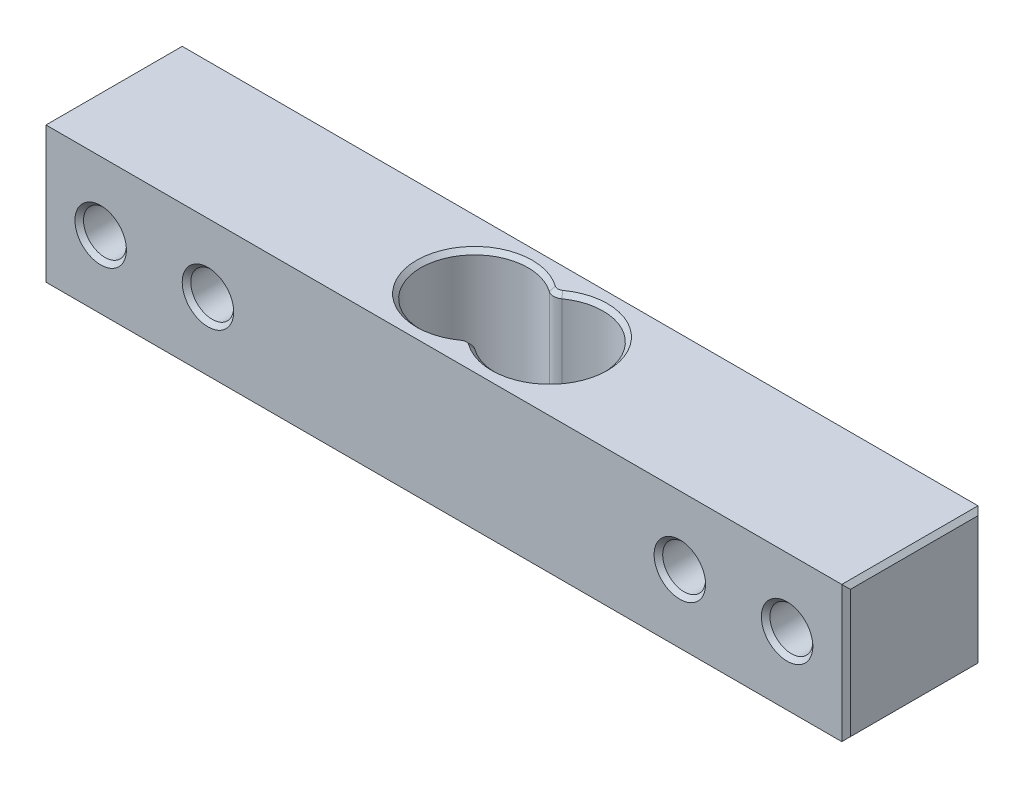
ISO-10303-21;
HEADER;
FILE_DESCRIPTION(('STEP AP214'),'2;1');
FILE_NAME('part.step','',(''),(''),'','','');
FILE_SCHEMA(('AUTOMOTIVE_DESIGN { 1 0 10303 214 1 1 1 1 }'));
ENDSEC;
DATA;
#1=APPLICATION_CONTEXT('core data for automotive mechanical design processes');
#2=APPLICATION_PROTOCOL_DEFINITION('international standard','automotive_design',2000,#1);
#3=PRODUCT_CONTEXT('',#1,'mechanical');
#4=PRODUCT('Part','Part','',(#3));
#5=PRODUCT_RELATED_PRODUCT_CATEGORY('part','',(#4));
#6=PRODUCT_DEFINITION_FORMATION('','',#4);
#7=PRODUCT_DEFINITION_CONTEXT('part definition',#1,'design');
#8=PRODUCT_DEFINITION('design','',#6,#7);
#9=PRODUCT_DEFINITION_SHAPE('','',#8);
#10=(LENGTH_UNIT() NAMED_UNIT(*) SI_UNIT(.MILLI.,.METRE.));
#11=(NAMED_UNIT(*) PLANE_ANGLE_UNIT() SI_UNIT($,.RADIAN.));
#12=(NAMED_UNIT(*) SI_UNIT($,.STERADIAN.) SOLID_ANGLE_UNIT());
#13=UNCERTAINTY_MEASURE_WITH_UNIT(LENGTH_MEASURE(1.E-05),#10,'distance_accuracy_value','');
#14=(GEOMETRIC_REPRESENTATION_CONTEXT(3) GLOBAL_UNCERTAINTY_ASSIGNED_CONTEXT((#13)) GLOBAL_UNIT_ASSIGNED_CONTEXT((#10,
#11,#12)) REPRESENTATION_CONTEXT('',''));
#15=CARTESIAN_POINT('',(0.,0.,0.));
#16=DIRECTION('',(0.,0.,1.));
#17=DIRECTION('',(1.,0.,0.));
#18=AXIS2_PLACEMENT_3D('',#15,#16,#17);
#19=CARTESIAN_POINT('',(0.,0.,12.7));
#20=DIRECTION('',(0.,0.,-1.));
#21=DIRECTION('',(-1.,0.,0.));
#22=AXIS2_PLACEMENT_3D('',#19,#20,#21);
#23=PLANE('',#22);
#24=CARTESIAN_POINT('',(32.,0.,12.7));
#25=DIRECTION('',(0.,0.,-1.));
#26=DIRECTION('',(-1.,0.,0.));
#27=AXIS2_PLACEMENT_3D('',#24,#25,#26);
#28=CIRCLE('',#27,2.39999999999999);
#29=CARTESIAN_POINT('',(29.6,0.,12.7));
#30=VERTEX_POINT('',#29);
#31=EDGE_CURVE('E260',#30,#30,#28,.T.);
#32=ORIENTED_EDGE('',*,*,#31,.T.);
#33=EDGE_LOOP('',(#32));
#34=FACE_BOUND('',#33,.T.);
#35=CARTESIAN_POINT('',(22.,0.,12.7));
#36=DIRECTION('',(0.,0.,-1.));
#37=DIRECTION('',(-1.,0.,0.));
#38=AXIS2_PLACEMENT_3D('',#35,#36,#37);
#39=CIRCLE('',#38,2.4);
#40=CARTESIAN_POINT('',(19.6,0.,12.7));
#41=VERTEX_POINT('',#40);
#42=EDGE_CURVE('E257',#41,#41,#39,.T.);
#43=ORIENTED_EDGE('',*,*,#42,.T.);
#44=EDGE_LOOP('',(#43));
#45=FACE_BOUND('',#44,.T.);
#46=CARTESIAN_POINT('',(-22.,0.,12.7));
#47=DIRECTION('',(0.,0.,-1.));
#48=DIRECTION('',(-1.,0.,0.));
#49=AXIS2_PLACEMENT_3D('',#46,#47,#48);
#50=CIRCLE('',#49,2.4);
#51=CARTESIAN_POINT('',(-24.4,0.,12.7));
#52=VERTEX_POINT('',#51);
#53=EDGE_CURVE('E254',#52,#52,#50,.T.);
#54=ORIENTED_EDGE('',*,*,#53,.T.);
#55=EDGE_LOOP('',(#54));
#56=FACE_BOUND('',#55,.T.);
#57=CARTESIAN_POINT('',(-32.,0.,12.7));
#58=DIRECTION('',(0.,0.,-1.));
#59=DIRECTION('',(-1.,0.,0.));
#60=AXIS2_PLACEMENT_3D('',#57,#58,#59);
#61=CIRCLE('',#60,2.4);
#62=CARTESIAN_POINT('',(-34.4,0.,12.7));
#63=VERTEX_POINT('',#62);
#64=EDGE_CURVE('E251',#63,#63,#61,.T.);
#65=ORIENTED_EDGE('',*,*,#64,.T.);
#66=EDGE_LOOP('',(#65));
#67=FACE_BOUND('',#66,.T.);
#68=DIRECTION('',(-1.,0.,0.));
#69=VECTOR('',#68,1.);
#70=CARTESIAN_POINT('',(-37.5,6.35,12.7));
#71=LINE('',#70,#69);
#72=CARTESIAN_POINT('',(37.1,6.35,12.7));
#73=VERTEX_POINT('',#72);
#74=CARTESIAN_POINT('',(-37.1,6.35,12.7));
#75=VERTEX_POINT('',#74);
#76=EDGE_CURVE('E357',#73,#75,#71,.T.);
#77=ORIENTED_EDGE('',*,*,#76,.T.);
#78=DIRECTION('',(0.,-1.,0.));
#79=VECTOR('',#78,1.);
#80=CARTESIAN_POINT('',(-37.1,0.,12.7));
#81=LINE('',#80,#79);
#82=CARTESIAN_POINT('',(-37.1,-6.35,12.7));
#83=VERTEX_POINT('',#82);
#84=EDGE_CURVE('E265',#75,#83,#81,.T.);
#85=ORIENTED_EDGE('',*,*,#84,.T.);
#86=DIRECTION('',(1.,0.,0.));
#87=VECTOR('',#86,1.);
#88=CARTESIAN_POINT('',(-37.5,-6.35,12.7));
#89=LINE('',#88,#87);
#90=CARTESIAN_POINT('',(37.1,-6.35,12.7));
#91=VERTEX_POINT('',#90);
#92=EDGE_CURVE('E203',#83,#91,#89,.T.);
#93=ORIENTED_EDGE('',*,*,#92,.T.);
#94=DIRECTION('',(0.,1.,0.));
#95=VECTOR('',#94,1.);
#96=CARTESIAN_POINT('',(37.1,0.,12.7));
#97=LINE('',#96,#95);
#98=EDGE_CURVE('E263',#91,#73,#97,.T.);
#99=ORIENTED_EDGE('',*,*,#98,.T.);
#100=EDGE_LOOP('',(#77,#85,#93,#99));
#101=FACE_BOUND('',#100,.T.);
#102=ADVANCED_FACE('F42',(#34,#45,#56,#67,#101),#23,.F.);
#103=CARTESIAN_POINT('',(0.,0.,0.));
#104=DIRECTION('',(0.,0.,-1.));
#105=DIRECTION('',(-1.,0.,0.));
#106=AXIS2_PLACEMENT_3D('',#103,#104,#105);
#107=PLANE('',#106);
#108=CARTESIAN_POINT('',(32.,0.,0.));
#109=DIRECTION('',(0.,0.,-1.));
#110=DIRECTION('',(-1.,0.,0.));
#111=AXIS2_PLACEMENT_3D('',#108,#109,#110);
#112=CIRCLE('',#111,2.40000000000001);
#113=CARTESIAN_POINT('',(29.6,0.,0.));
#114=VERTEX_POINT('',#113);
#115=EDGE_CURVE('E276',#114,#114,#112,.F.);
#116=ORIENTED_EDGE('',*,*,#115,.T.);
#117=EDGE_LOOP('',(#116));
#118=FACE_BOUND('',#117,.T.);
#119=CARTESIAN_POINT('',(22.,0.,0.));
#120=DIRECTION('',(0.,0.,-1.));
#121=DIRECTION('',(-1.,0.,0.));
#122=AXIS2_PLACEMENT_3D('',#119,#120,#121);
#123=CIRCLE('',#122,2.40000000000001);
#124=CARTESIAN_POINT('',(19.6,0.,0.));
#125=VERTEX_POINT('',#124);
#126=EDGE_CURVE('E273',#125,#125,#123,.F.);
#127=ORIENTED_EDGE('',*,*,#126,.T.);
#128=EDGE_LOOP('',(#127));
#129=FACE_BOUND('',#128,.T.);
#130=CARTESIAN_POINT('',(-22.,0.,0.));
#131=DIRECTION('',(0.,0.,-1.));
#132=DIRECTION('',(-1.,0.,0.));
#133=AXIS2_PLACEMENT_3D('',#130,#131,#132);
#134=CIRCLE('',#133,2.40000000000001);
#135=CARTESIAN_POINT('',(-24.4,0.,0.));
#136=VERTEX_POINT('',#135);
#137=EDGE_CURVE('E270',#136,#136,#134,.F.);
#138=ORIENTED_EDGE('',*,*,#137,.T.);
#139=EDGE_LOOP('',(#138));
#140=FACE_BOUND('',#139,.T.);
#141=CARTESIAN_POINT('',(-32.,0.,0.));
#142=DIRECTION('',(0.,0.,-1.));
#143=DIRECTION('',(-1.,0.,0.));
#144=AXIS2_PLACEMENT_3D('',#141,#142,#143);
#145=CIRCLE('',#144,2.40000000000001);
#146=CARTESIAN_POINT('',(-34.4,0.,0.));
#147=VERTEX_POINT('',#146);
#148=EDGE_CURVE('E267',#147,#147,#145,.F.);
#149=ORIENTED_EDGE('',*,*,#148,.T.);
#150=EDGE_LOOP('',(#149));
#151=FACE_BOUND('',#150,.T.);
#152=DIRECTION('',(1.,0.,0.));
#153=VECTOR('',#152,1.);
#154=CARTESIAN_POINT('',(-37.5,-6.35,0.));
#155=LINE('',#154,#153);
#156=CARTESIAN_POINT('',(-37.1,-6.35,0.));
#157=VERTEX_POINT('',#156);
#158=CARTESIAN_POINT('',(37.1,-6.35,0.));
#159=VERTEX_POINT('',#158);
#160=EDGE_CURVE('E363',#157,#159,#155,.T.);
#161=ORIENTED_EDGE('',*,*,#160,.F.);
#162=DIRECTION('',(0.,1.,0.));
#163=VECTOR('',#162,1.);
#164=CARTESIAN_POINT('',(-37.1,6.35,0.));
#165=LINE('',#164,#163);
#166=CARTESIAN_POINT('',(-37.1,6.35,0.));
#167=VERTEX_POINT('',#166);
#168=EDGE_CURVE('E281',#157,#167,#165,.T.);
#169=ORIENTED_EDGE('',*,*,#168,.T.);
#170=DIRECTION('',(-1.,0.,0.));
#171=VECTOR('',#170,1.);
#172=CARTESIAN_POINT('',(-37.5,6.35,0.));
#173=LINE('',#172,#171);
#174=CARTESIAN_POINT('',(37.1,6.35,0.));
#175=VERTEX_POINT('',#174);
#176=EDGE_CURVE('E314',#175,#167,#173,.T.);
#177=ORIENTED_EDGE('',*,*,#176,.F.);
#178=DIRECTION('',(0.,-1.,0.));
#179=VECTOR('',#178,1.);
#180=CARTESIAN_POINT('',(37.1,-6.35,0.));
#181=LINE('',#180,#179);
#182=EDGE_CURVE('E279',#175,#159,#181,.T.);
#183=ORIENTED_EDGE('',*,*,#182,.T.);
#184=EDGE_LOOP('',(#161,#169,#177,#183));
#185=FACE_BOUND('',#184,.T.);
#186=ADVANCED_FACE('F360',(#118,#129,#140,#151,#185),#107,.T.);
#187=CARTESIAN_POINT('',(37.5,-6.35,12.7));
#188=DIRECTION('',(-1.,0.,0.));
#189=DIRECTION('',(0.,0.,1.));
#190=AXIS2_PLACEMENT_3D('',#187,#188,#189);
#191=PLANE('',#190);
#192=DIRECTION('',(0.,-1.,0.));
#193=VECTOR('',#192,1.);
#194=CARTESIAN_POINT('',(37.5,-6.35,12.3));
#195=LINE('',#194,#193);
#196=CARTESIAN_POINT('',(37.5,5.95,12.3));
#197=VERTEX_POINT('',#196);
#198=CARTESIAN_POINT('',(37.5,-5.95,12.3));
#199=VERTEX_POINT('',#198);
#200=EDGE_CURVE('E60',#197,#199,#195,.T.);
#201=ORIENTED_EDGE('',*,*,#200,.T.);
#202=DIRECTION('',(0.,0.,-1.));
#203=VECTOR('',#202,1.);
#204=CARTESIAN_POINT('',(37.5,-5.95,12.7));
#205=LINE('',#204,#203);
#206=CARTESIAN_POINT('',(37.5,-5.95,0.399999999999998));
#207=VERTEX_POINT('',#206);
#208=EDGE_CURVE('E287',#199,#207,#205,.T.);
#209=ORIENTED_EDGE('',*,*,#208,.T.);
#210=DIRECTION('',(0.,1.,0.));
#211=VECTOR('',#210,1.);
#212=CARTESIAN_POINT('',(37.5,6.35,0.399999999999998));
#213=LINE('',#212,#211);
#214=CARTESIAN_POINT('',(37.5,5.95,0.399999999999998));
#215=VERTEX_POINT('',#214);
#216=EDGE_CURVE('E283',#207,#215,#213,.T.);
#217=ORIENTED_EDGE('',*,*,#216,.T.);
#218=DIRECTION('',(0.,0.,1.));
#219=VECTOR('',#218,1.);
#220=CARTESIAN_POINT('',(37.5,5.95,12.7));
#221=LINE('',#220,#219);
#222=EDGE_CURVE('E65',#215,#197,#221,.T.);
#223=ORIENTED_EDGE('',*,*,#222,.T.);
#224=EDGE_LOOP('',(#201,#209,#217,#223));
#225=FACE_BOUND('',#224,.T.);
#226=ADVANCED_FACE('F409',(#225),#191,.F.);
#227=CARTESIAN_POINT('',(-37.5,6.35,12.7));
#228=DIRECTION('',(0.,-1.,0.));
#229=DIRECTION('',(0.,0.,-1.));
#230=AXIS2_PLACEMENT_3D('',#227,#228,#229);
#231=PLANE('',#230);
#232=CARTESIAN_POINT('',(0.,6.35,1.47660282759551));
#233=DIRECTION('',(0.,-1.,0.));
#234=DIRECTION('',(0.,0.,-1.));
#235=AXIS2_PLACEMENT_3D('',#232,#233,#234);
#236=CIRCLE('',#235,0.60000000000002);
#237=CARTESIAN_POINT('',(-0.350000000000014,6.35,1.96394254483598));
#238=VERTEX_POINT('',#237);
#239=CARTESIAN_POINT('',(0.35000000000001,6.35,1.96394254483598));
#240=VERTEX_POINT('',#239);
#241=EDGE_CURVE('E237',#238,#240,#236,.F.);
#242=ORIENTED_EDGE('',*,*,#241,.T.);
#243=CARTESIAN_POINT('',(3.5,6.35,6.35));
#244=DIRECTION('',(0.,-1.,0.));
#245=DIRECTION('',(0.,0.,-1.));
#246=AXIS2_PLACEMENT_3D('',#243,#244,#245);
#247=CIRCLE('',#246,5.39999999999998);
#248=CARTESIAN_POINT('',(0.350000000000009,6.35,10.736057455164));
#249=VERTEX_POINT('',#248);
#250=EDGE_CURVE('E239',#240,#249,#247,.T.);
#251=ORIENTED_EDGE('',*,*,#250,.T.);
#252=CARTESIAN_POINT('',(0.,6.35,11.2233971724045));
#253=DIRECTION('',(0.,-1.,0.));
#254=DIRECTION('',(0.,0.,-1.));
#255=AXIS2_PLACEMENT_3D('',#252,#253,#254);
#256=CIRCLE('',#255,0.60000000000002);
#257=CARTESIAN_POINT('',(-0.350000000000014,6.35,10.736057455164));
#258=VERTEX_POINT('',#257);
#259=EDGE_CURVE('E235',#249,#258,#256,.F.);
#260=ORIENTED_EDGE('',*,*,#259,.T.);
#261=CARTESIAN_POINT('',(-3.5,6.35,6.35));
#262=DIRECTION('',(0.,-1.,0.));
#263=DIRECTION('',(0.,0.,-1.));
#264=AXIS2_PLACEMENT_3D('',#261,#262,#263);
#265=CIRCLE('',#264,5.39999999999998);
#266=EDGE_CURVE('E233',#258,#238,#265,.T.);
#267=ORIENTED_EDGE('',*,*,#266,.T.);
#268=EDGE_LOOP('',(#242,#251,#260,#267));
#269=FACE_BOUND('',#268,.T.);
#270=ORIENTED_EDGE('',*,*,#176,.T.);
#271=DIRECTION('',(0.,0.,1.));
#272=VECTOR('',#271,1.);
#273=CARTESIAN_POINT('',(-37.1,6.35,12.7));
#274=LINE('',#273,#272);
#275=EDGE_CURVE('E230',#167,#75,#274,.T.);
#276=ORIENTED_EDGE('',*,*,#275,.T.);
#277=ORIENTED_EDGE('',*,*,#76,.F.);
#278=DIRECTION('',(0.,0.,-1.));
#279=VECTOR('',#278,1.);
#280=CARTESIAN_POINT('',(37.1,6.35,12.7));
#281=LINE('',#280,#279);
#282=EDGE_CURVE('E228',#73,#175,#281,.T.);
#283=ORIENTED_EDGE('',*,*,#282,.T.);
#284=EDGE_LOOP('',(#270,#276,#277,#283));
#285=FACE_BOUND('',#284,.T.);
#286=ADVANCED_FACE('F354',(#269,#285),#231,.F.);
#287=CARTESIAN_POINT('',(-37.5,-6.35,12.7));
#288=DIRECTION('',(1.,0.,0.));
#289=DIRECTION('',(0.,0.,-1.));
#290=AXIS2_PLACEMENT_3D('',#287,#288,#289);
#291=PLANE('',#290);
#292=DIRECTION('',(0.,1.,0.));
#293=VECTOR('',#292,1.);
#294=CARTESIAN_POINT('',(-37.5,-6.35,12.3));
#295=LINE('',#294,#293);
#296=CARTESIAN_POINT('',(-37.5,-5.95,12.3));
#297=VERTEX_POINT('',#296);
#298=CARTESIAN_POINT('',(-37.5,5.95,12.3));
#299=VERTEX_POINT('',#298);
#300=EDGE_CURVE('E246',#297,#299,#295,.T.);
#301=ORIENTED_EDGE('',*,*,#300,.T.);
#302=DIRECTION('',(0.,0.,-1.));
#303=VECTOR('',#302,1.);
#304=CARTESIAN_POINT('',(-37.5,5.95,12.7));
#305=LINE('',#304,#303);
#306=CARTESIAN_POINT('',(-37.5,5.95,0.399999999999998));
#307=VERTEX_POINT('',#306);
#308=EDGE_CURVE('E248',#299,#307,#305,.T.);
#309=ORIENTED_EDGE('',*,*,#308,.T.);
#310=DIRECTION('',(0.,-1.,0.));
#311=VECTOR('',#310,1.);
#312=CARTESIAN_POINT('',(-37.5,-6.35,0.399999999999998));
#313=LINE('',#312,#311);
#314=CARTESIAN_POINT('',(-37.5,-5.95,0.399999999999998));
#315=VERTEX_POINT('',#314);
#316=EDGE_CURVE('E242',#307,#315,#313,.T.);
#317=ORIENTED_EDGE('',*,*,#316,.T.);
#318=DIRECTION('',(0.,0.,1.));
#319=VECTOR('',#318,1.);
#320=CARTESIAN_POINT('',(-37.5,-5.95,12.7));
#321=LINE('',#320,#319);
#322=EDGE_CURVE('E244',#315,#297,#321,.T.);
#323=ORIENTED_EDGE('',*,*,#322,.T.);
#324=EDGE_LOOP('',(#301,#309,#317,#323));
#325=FACE_BOUND('',#324,.T.);
#326=ADVANCED_FACE('F386',(#325),#291,.F.);
#327=CARTESIAN_POINT('',(-37.5,-6.35,12.7));
#328=DIRECTION('',(0.,1.,0.));
#329=DIRECTION('',(0.,0.,1.));
#330=AXIS2_PLACEMENT_3D('',#327,#328,#329);
#331=PLANE('',#330);
#332=CARTESIAN_POINT('',(0.,-6.35,11.2233971724045));
#333=DIRECTION('',(0.,1.,0.));
#334=DIRECTION('',(0.,0.,1.));
#335=AXIS2_PLACEMENT_3D('',#332,#333,#334);
#336=CIRCLE('',#335,0.600000000000012);
#337=CARTESIAN_POINT('',(-0.35000000000001,-6.35,10.736057455164));
#338=VERTEX_POINT('',#337);
#339=CARTESIAN_POINT('',(0.350000000000005,-6.35,10.736057455164));
#340=VERTEX_POINT('',#339);
#341=EDGE_CURVE('E217',#338,#340,#336,.F.);
#342=ORIENTED_EDGE('',*,*,#341,.T.);
#343=CARTESIAN_POINT('',(3.5,-6.35,6.35));
#344=DIRECTION('',(0.,1.,0.));
#345=DIRECTION('',(0.,0.,1.));
#346=AXIS2_PLACEMENT_3D('',#343,#344,#345);
#347=CIRCLE('',#346,5.39999999999999);
#348=CARTESIAN_POINT('',(0.350000000000005,-6.35,1.96394254483597));
#349=VERTEX_POINT('',#348);
#350=EDGE_CURVE('E165',#340,#349,#347,.T.);
#351=ORIENTED_EDGE('',*,*,#350,.T.);
#352=CARTESIAN_POINT('',(0.,-6.35,1.47660282759551));
#353=DIRECTION('',(0.,1.,0.));
#354=DIRECTION('',(0.,0.,1.));
#355=AXIS2_PLACEMENT_3D('',#352,#353,#354);
#356=CIRCLE('',#355,0.600000000000013);
#357=CARTESIAN_POINT('',(-0.350000000000009,-6.35,1.96394254483597));
#358=VERTEX_POINT('',#357);
#359=EDGE_CURVE('E215',#349,#358,#356,.F.);
#360=ORIENTED_EDGE('',*,*,#359,.T.);
#361=CARTESIAN_POINT('',(-3.5,-6.35,6.35));
#362=DIRECTION('',(0.,1.,0.));
#363=DIRECTION('',(0.,0.,1.));
#364=AXIS2_PLACEMENT_3D('',#361,#362,#363);
#365=CIRCLE('',#364,5.39999999999999);
#366=EDGE_CURVE('E213',#358,#338,#365,.T.);
#367=ORIENTED_EDGE('',*,*,#366,.T.);
#368=EDGE_LOOP('',(#342,#351,#360,#367));
#369=FACE_BOUND('',#368,.T.);
#370=ORIENTED_EDGE('',*,*,#92,.F.);
#371=DIRECTION('',(0.,0.,-1.));
#372=VECTOR('',#371,1.);
#373=CARTESIAN_POINT('',(-37.1,-6.35,12.7));
#374=LINE('',#373,#372);
#375=EDGE_CURVE('E211',#83,#157,#374,.T.);
#376=ORIENTED_EDGE('',*,*,#375,.T.);
#377=ORIENTED_EDGE('',*,*,#160,.T.);
#378=DIRECTION('',(0.,0.,1.));
#379=VECTOR('',#378,1.);
#380=CARTESIAN_POINT('',(37.1,-6.35,12.7));
#381=LINE('',#380,#379);
#382=EDGE_CURVE('E193',#159,#91,#381,.T.);
#383=ORIENTED_EDGE('',*,*,#382,.T.);
#384=EDGE_LOOP('',(#370,#376,#377,#383));
#385=FACE_BOUND('',#384,.T.);
#386=ADVANCED_FACE('F373',(#369,#385),#331,.F.);
#387=CARTESIAN_POINT('',(-32.,0.,12.7));
#388=DIRECTION('',(0.,0.,-1.));
#389=DIRECTION('',(-1.,0.,0.));
#390=AXIS2_PLACEMENT_3D('',#387,#388,#389);
#391=CYLINDRICAL_SURFACE('',#390,2.);
#392=CARTESIAN_POINT('',(-32.,0.,0.400000000000003));
#393=DIRECTION('',(0.,0.,-1.));
#394=DIRECTION('',(-1.,0.,0.));
#395=AXIS2_PLACEMENT_3D('',#392,#393,#394);
#396=CIRCLE('',#395,2.);
#397=CARTESIAN_POINT('',(-34.,0.,0.400000000000003));
#398=VERTEX_POINT('',#397);
#399=EDGE_CURVE('E11',#398,#398,#396,.T.);
#400=ORIENTED_EDGE('',*,*,#399,.T.);
#401=EDGE_LOOP('',(#400));
#402=FACE_BOUND('',#401,.T.);
#403=CARTESIAN_POINT('',(-32.,0.,12.3));
#404=DIRECTION('',(0.,0.,-1.));
#405=DIRECTION('',(-1.,0.,0.));
#406=AXIS2_PLACEMENT_3D('',#403,#404,#405);
#407=CIRCLE('',#406,2.);
#408=CARTESIAN_POINT('',(-34.,0.,12.3));
#409=VERTEX_POINT('',#408);
#410=EDGE_CURVE('E52',#409,#409,#407,.F.);
#411=ORIENTED_EDGE('',*,*,#410,.T.);
#412=EDGE_LOOP('',(#411));
#413=FACE_BOUND('',#412,.T.);
#414=ADVANCED_FACE('F414',(#402,#413),#391,.F.);
#415=CARTESIAN_POINT('',(-22.,0.,12.7));
#416=DIRECTION('',(0.,0.,-1.));
#417=DIRECTION('',(-1.,0.,0.));
#418=AXIS2_PLACEMENT_3D('',#415,#416,#417);
#419=CYLINDRICAL_SURFACE('',#418,2.);
#420=CARTESIAN_POINT('',(-22.,0.,0.400000000000003));
#421=DIRECTION('',(0.,0.,-1.));
#422=DIRECTION('',(-1.,0.,0.));
#423=AXIS2_PLACEMENT_3D('',#420,#421,#422);
#424=CIRCLE('',#423,2.);
#425=CARTESIAN_POINT('',(-24.,0.,0.400000000000003));
#426=VERTEX_POINT('',#425);
#427=EDGE_CURVE('E304',#426,#426,#424,.T.);
#428=ORIENTED_EDGE('',*,*,#427,.T.);
#429=EDGE_LOOP('',(#428));
#430=FACE_BOUND('',#429,.T.);
#431=CARTESIAN_POINT('',(-22.,0.,12.3));
#432=DIRECTION('',(0.,0.,-1.));
#433=DIRECTION('',(-1.,0.,0.));
#434=AXIS2_PLACEMENT_3D('',#431,#432,#433);
#435=CIRCLE('',#434,2.);
#436=CARTESIAN_POINT('',(-24.,0.,12.3));
#437=VERTEX_POINT('',#436);
#438=EDGE_CURVE('E301',#437,#437,#435,.F.);
#439=ORIENTED_EDGE('',*,*,#438,.T.);
#440=EDGE_LOOP('',(#439));
#441=FACE_BOUND('',#440,.T.);
#442=ADVANCED_FACE('F517',(#430,#441),#419,.F.);
#443=CARTESIAN_POINT('',(22.,0.,12.7));
#444=DIRECTION('',(0.,0.,-1.));
#445=DIRECTION('',(-1.,0.,0.));
#446=AXIS2_PLACEMENT_3D('',#443,#444,#445);
#447=CYLINDRICAL_SURFACE('',#446,2.);
#448=CARTESIAN_POINT('',(22.,0.,0.400000000000003));
#449=DIRECTION('',(0.,0.,-1.));
#450=DIRECTION('',(-1.,0.,0.));
#451=AXIS2_PLACEMENT_3D('',#448,#449,#450);
#452=CIRCLE('',#451,2.);
#453=CARTESIAN_POINT('',(20.,0.,0.400000000000003));
#454=VERTEX_POINT('',#453);
#455=EDGE_CURVE('E298',#454,#454,#452,.T.);
#456=ORIENTED_EDGE('',*,*,#455,.T.);
#457=EDGE_LOOP('',(#456));
#458=FACE_BOUND('',#457,.T.);
#459=CARTESIAN_POINT('',(22.,0.,12.3));
#460=DIRECTION('',(0.,0.,-1.));
#461=DIRECTION('',(-1.,0.,0.));
#462=AXIS2_PLACEMENT_3D('',#459,#460,#461);
#463=CIRCLE('',#462,2.);
#464=CARTESIAN_POINT('',(20.,0.,12.3));
#465=VERTEX_POINT('',#464);
#466=EDGE_CURVE('E295',#465,#465,#463,.F.);
#467=ORIENTED_EDGE('',*,*,#466,.T.);
#468=EDGE_LOOP('',(#467));
#469=FACE_BOUND('',#468,.T.);
#470=ADVANCED_FACE('F514',(#458,#469),#447,.F.);
#471=CARTESIAN_POINT('',(32.,0.,12.7));
#472=DIRECTION('',(0.,0.,-1.));
#473=DIRECTION('',(-1.,0.,0.));
#474=AXIS2_PLACEMENT_3D('',#471,#472,#473);
#475=CYLINDRICAL_SURFACE('',#474,2.);
#476=CARTESIAN_POINT('',(32.,0.,0.400000000000003));
#477=DIRECTION('',(0.,0.,-1.));
#478=DIRECTION('',(-1.,0.,0.));
#479=AXIS2_PLACEMENT_3D('',#476,#477,#478);
#480=CIRCLE('',#479,2.);
#481=CARTESIAN_POINT('',(30.,0.,0.400000000000003));
#482=VERTEX_POINT('',#481);
#483=EDGE_CURVE('E292',#482,#482,#480,.T.);
#484=ORIENTED_EDGE('',*,*,#483,.T.);
#485=EDGE_LOOP('',(#484));
#486=FACE_BOUND('',#485,.T.);
#487=CARTESIAN_POINT('',(32.,0.,12.3));
#488=DIRECTION('',(0.,0.,-1.));
#489=DIRECTION('',(-1.,0.,0.));
#490=AXIS2_PLACEMENT_3D('',#487,#488,#489);
#491=CIRCLE('',#490,2.);
#492=CARTESIAN_POINT('',(30.,0.,12.3));
#493=VERTEX_POINT('',#492);
#494=EDGE_CURVE('E289',#493,#493,#491,.F.);
#495=ORIENTED_EDGE('',*,*,#494,.T.);
#496=EDGE_LOOP('',(#495));
#497=FACE_BOUND('',#496,.T.);
#498=ADVANCED_FACE('F509',(#486,#497),#475,.F.);
#499=CARTESIAN_POINT('',(3.5,-6.351,6.35));
#500=DIRECTION('',(0.,1.,0.));
#501=DIRECTION('',(0.,0.,1.));
#502=AXIS2_PLACEMENT_3D('',#499,#500,#501);
#503=CYLINDRICAL_SURFACE('',#502,5.);
#504=DIRECTION('',(0.,1.,0.));
#505=VECTOR('',#504,1.);
#506=CARTESIAN_POINT('',(0.583333333333331,-6.351,2.28883568966293));
#507=LINE('',#506,#505);
#508=CARTESIAN_POINT('',(0.583333333333331,5.95000000000002,2.28883568966293));
#509=VERTEX_POINT('',#508);
#510=CARTESIAN_POINT('',(0.583333333333331,-5.95000000000002,2.28883568966293));
#511=VERTEX_POINT('',#510);
#512=EDGE_CURVE('E191',#509,#511,#507,.F.);
#513=ORIENTED_EDGE('',*,*,#512,.T.);
#514=CARTESIAN_POINT('',(3.5,-5.95000000000002,6.35));
#515=DIRECTION('',(0.,1.,0.));
#516=DIRECTION('',(0.,0.,1.));
#517=AXIS2_PLACEMENT_3D('',#514,#515,#516);
#518=CIRCLE('',#517,5.);
#519=CARTESIAN_POINT('',(0.583333333333331,-5.95000000000002,10.4111643103371));
#520=VERTEX_POINT('',#519);
#521=EDGE_CURVE('E163',#511,#520,#518,.F.);
#522=ORIENTED_EDGE('',*,*,#521,.T.);
#523=DIRECTION('',(0.,1.,0.));
#524=VECTOR('',#523,1.);
#525=CARTESIAN_POINT('',(0.583333333333331,-6.351,10.4111643103371));
#526=LINE('',#525,#524);
#527=CARTESIAN_POINT('',(0.583333333333331,5.95000000000002,10.4111643103371));
#528=VERTEX_POINT('',#527);
#529=EDGE_CURVE('E188',#520,#528,#526,.T.);
#530=ORIENTED_EDGE('',*,*,#529,.T.);
#531=CARTESIAN_POINT('',(3.5,5.95000000000002,6.35));
#532=DIRECTION('',(0.,-1.,0.));
#533=DIRECTION('',(0.,0.,-1.));
#534=AXIS2_PLACEMENT_3D('',#531,#532,#533);
#535=CIRCLE('',#534,5.);
#536=EDGE_CURVE('E194',#528,#509,#535,.F.);
#537=ORIENTED_EDGE('',*,*,#536,.T.);
#538=EDGE_LOOP('',(#513,#522,#530,#537));
#539=FACE_BOUND('',#538,.T.);
#540=ADVANCED_FACE('F186',(#539),#503,.F.);
#541=CARTESIAN_POINT('',(-3.5,-6.351,6.35));
#542=DIRECTION('',(0.,1.,0.));
#543=DIRECTION('',(0.,0.,1.));
#544=AXIS2_PLACEMENT_3D('',#541,#542,#543);
#545=CYLINDRICAL_SURFACE('',#544,5.);
#546=DIRECTION('',(0.,1.,0.));
#547=VECTOR('',#546,1.);
#548=CARTESIAN_POINT('',(-0.583333333333335,-6.351,10.4111643103371));
#549=LINE('',#548,#547);
#550=CARTESIAN_POINT('',(-0.583333333333335,5.95000000000002,10.4111643103371));
#551=VERTEX_POINT('',#550);
#552=CARTESIAN_POINT('',(-0.583333333333335,-5.95000000000002,10.4111643103371));
#553=VERTEX_POINT('',#552);
#554=EDGE_CURVE('E201',#551,#553,#549,.F.);
#555=ORIENTED_EDGE('',*,*,#554,.T.);
#556=CARTESIAN_POINT('',(-3.5,-5.95000000000002,6.35));
#557=DIRECTION('',(0.,1.,0.));
#558=DIRECTION('',(0.,0.,1.));
#559=AXIS2_PLACEMENT_3D('',#556,#557,#558);
#560=CIRCLE('',#559,5.);
#561=CARTESIAN_POINT('',(-0.583333333333335,-5.95000000000002,2.28883568966293));
#562=VERTEX_POINT('',#561);
#563=EDGE_CURVE('E226',#553,#562,#560,.F.);
#564=ORIENTED_EDGE('',*,*,#563,.T.);
#565=DIRECTION('',(0.,1.,0.));
#566=VECTOR('',#565,1.);
#567=CARTESIAN_POINT('',(-0.583333333333335,-6.351,2.28883568966293));
#568=LINE('',#567,#566);
#569=CARTESIAN_POINT('',(-0.583333333333335,5.95000000000002,2.28883568966293));
#570=VERTEX_POINT('',#569);
#571=EDGE_CURVE('E198',#562,#570,#568,.T.);
#572=ORIENTED_EDGE('',*,*,#571,.T.);
#573=CARTESIAN_POINT('',(-3.5,5.95000000000002,6.35));
#574=DIRECTION('',(0.,-1.,0.));
#575=DIRECTION('',(0.,0.,-1.));
#576=AXIS2_PLACEMENT_3D('',#573,#574,#575);
#577=CIRCLE('',#576,5.);
#578=EDGE_CURVE('E224',#570,#551,#577,.F.);
#579=ORIENTED_EDGE('',*,*,#578,.T.);
#580=EDGE_LOOP('',(#555,#564,#572,#579));
#581=FACE_BOUND('',#580,.T.);
#582=ADVANCED_FACE('F430',(#581),#545,.F.);
#583=CARTESIAN_POINT('',(0.,-6.351,11.2233971724045));
#584=DIRECTION('',(0.,1.,0.));
#585=DIRECTION('',(0.,0.,1.));
#586=AXIS2_PLACEMENT_3D('',#583,#584,#585);
#587=CYLINDRICAL_SURFACE('',#586,1.);
#588=ORIENTED_EDGE('',*,*,#529,.F.);
#589=CARTESIAN_POINT('',(0.,-5.95000000000002,11.2233971724045));
#590=DIRECTION('',(0.,1.,0.));
#591=DIRECTION('',(0.,0.,1.));
#592=AXIS2_PLACEMENT_3D('',#589,#590,#591);
#593=CIRCLE('',#592,1.);
#594=EDGE_CURVE('E172',#520,#553,#593,.T.);
#595=ORIENTED_EDGE('',*,*,#594,.T.);
#596=ORIENTED_EDGE('',*,*,#554,.F.);
#597=CARTESIAN_POINT('',(0.,5.95000000000002,11.2233971724045));
#598=DIRECTION('',(0.,-1.,0.));
#599=DIRECTION('',(0.,0.,-1.));
#600=AXIS2_PLACEMENT_3D('',#597,#598,#599);
#601=CIRCLE('',#600,1.);
#602=EDGE_CURVE('E181',#551,#528,#601,.T.);
#603=ORIENTED_EDGE('',*,*,#602,.T.);
#604=EDGE_LOOP('',(#588,#595,#596,#603));
#605=FACE_BOUND('',#604,.T.);
#606=ADVANCED_FACE('F196',(#605),#587,.T.);
#607=CARTESIAN_POINT('',(0.,-6.351,1.47660282759551));
#608=DIRECTION('',(0.,1.,0.));
#609=DIRECTION('',(0.,0.,1.));
#610=AXIS2_PLACEMENT_3D('',#607,#608,#609);
#611=CYLINDRICAL_SURFACE('',#610,1.);
#612=ORIENTED_EDGE('',*,*,#571,.F.);
#613=CARTESIAN_POINT('',(0.,-5.95000000000002,1.47660282759551));
#614=DIRECTION('',(0.,1.,0.));
#615=DIRECTION('',(0.,0.,1.));
#616=AXIS2_PLACEMENT_3D('',#613,#614,#615);
#617=CIRCLE('',#616,1.);
#618=EDGE_CURVE('E222',#562,#511,#617,.T.);
#619=ORIENTED_EDGE('',*,*,#618,.T.);
#620=ORIENTED_EDGE('',*,*,#512,.F.);
#621=CARTESIAN_POINT('',(0.,5.95000000000002,1.47660282759551));
#622=DIRECTION('',(0.,-1.,0.));
#623=DIRECTION('',(0.,0.,-1.));
#624=AXIS2_PLACEMENT_3D('',#621,#622,#623);
#625=CIRCLE('',#624,1.);
#626=EDGE_CURVE('E180',#509,#570,#625,.T.);
#627=ORIENTED_EDGE('',*,*,#626,.T.);
#628=EDGE_LOOP('',(#612,#619,#620,#627));
#629=FACE_BOUND('',#628,.T.);
#630=ADVANCED_FACE('F429',(#629),#611,.T.);
#631=CARTESIAN_POINT('',(-3.5,-5.95000000000002,6.35));
#632=DIRECTION('',(0.,-1.,0.));
#633=DIRECTION('',(0.,0.,-1.));
#634=AXIS2_PLACEMENT_3D('',#631,#632,#633);
#635=CONICAL_SURFACE('',#634,5.,0.785398163397453);
#636=DIRECTION('',(-0.412478955692154,0.707106781186545,-0.574335364670428));
#637=VECTOR('',#636,1.);
#638=CARTESIAN_POINT('',(-0.35000000000001,-6.35,10.736057455164));
#639=LINE('',#638,#637);
#640=EDGE_CURVE('E175',#338,#553,#639,.T.);
#641=ORIENTED_EDGE('',*,*,#640,.F.);
#642=ORIENTED_EDGE('',*,*,#366,.F.);
#643=DIRECTION('',(0.412478955692154,-0.707106781186544,-0.574335364670429));
#644=VECTOR('',#643,1.);
#645=CARTESIAN_POINT('',(-0.583333333333335,-5.95000000000002,2.28883568966293));
#646=LINE('',#645,#644);
#647=EDGE_CURVE('E311',#562,#358,#646,.T.);
#648=ORIENTED_EDGE('',*,*,#647,.F.);
#649=ORIENTED_EDGE('',*,*,#563,.F.);
#650=EDGE_LOOP('',(#641,#642,#648,#649));
#651=FACE_BOUND('',#650,.T.);
#652=ADVANCED_FACE('F433',(#651),#635,.F.);
#653=CARTESIAN_POINT('',(0.,-6.35,1.47660282759551));
#654=DIRECTION('',(0.,1.,0.));
#655=DIRECTION('',(0.,0.,1.));
#656=AXIS2_PLACEMENT_3D('',#653,#654,#655);
#657=CONICAL_SURFACE('',#656,0.600000000000013,0.785398163397452);
#658=ORIENTED_EDGE('',*,*,#647,.T.);
#659=ORIENTED_EDGE('',*,*,#359,.F.);
#660=DIRECTION('',(-0.412478955692154,-0.707106781186545,-0.574335364670428));
#661=VECTOR('',#660,1.);
#662=CARTESIAN_POINT('',(0.583333333333331,-5.95000000000002,2.28883568966293));
#663=LINE('',#662,#661);
#664=EDGE_CURVE('E168',#511,#349,#663,.T.);
#665=ORIENTED_EDGE('',*,*,#664,.F.);
#666=ORIENTED_EDGE('',*,*,#618,.F.);
#667=EDGE_LOOP('',(#658,#659,#665,#666));
#668=FACE_BOUND('',#667,.T.);
#669=ADVANCED_FACE('F448',(#668),#657,.T.);
#670=CARTESIAN_POINT('',(0.,-6.35,11.2233971724045));
#671=DIRECTION('',(0.,1.,0.));
#672=DIRECTION('',(0.,0.,1.));
#673=AXIS2_PLACEMENT_3D('',#670,#671,#672);
#674=CONICAL_SURFACE('',#673,0.600000000000012,0.785398163397452);
#675=ORIENTED_EDGE('',*,*,#640,.T.);
#676=ORIENTED_EDGE('',*,*,#594,.F.);
#677=DIRECTION('',(0.412478955692154,0.707106781186545,-0.574335364670428));
#678=VECTOR('',#677,1.);
#679=CARTESIAN_POINT('',(0.350000000000005,-6.35,10.736057455164));
#680=LINE('',#679,#678);
#681=EDGE_CURVE('E159',#340,#520,#680,.T.);
#682=ORIENTED_EDGE('',*,*,#681,.F.);
#683=ORIENTED_EDGE('',*,*,#341,.F.);
#684=EDGE_LOOP('',(#675,#676,#682,#683));
#685=FACE_BOUND('',#684,.T.);
#686=ADVANCED_FACE('F173',(#685),#674,.T.);
#687=CARTESIAN_POINT('',(3.5,-5.95000000000002,6.35));
#688=DIRECTION('',(0.,-1.,0.));
#689=DIRECTION('',(0.,0.,-1.));
#690=AXIS2_PLACEMENT_3D('',#687,#688,#689);
#691=CONICAL_SURFACE('',#690,5.,0.785398163397452);
#692=ORIENTED_EDGE('',*,*,#664,.T.);
#693=ORIENTED_EDGE('',*,*,#350,.F.);
#694=ORIENTED_EDGE('',*,*,#681,.T.);
#695=ORIENTED_EDGE('',*,*,#521,.F.);
#696=EDGE_LOOP('',(#692,#693,#694,#695));
#697=FACE_BOUND('',#696,.T.);
#698=ADVANCED_FACE('F161',(#697),#691,.F.);
#699=CARTESIAN_POINT('',(-3.5,5.95000000000002,6.35));
#700=DIRECTION('',(0.,1.,0.));
#701=DIRECTION('',(0.,0.,1.));
#702=AXIS2_PLACEMENT_3D('',#699,#700,#701);
#703=CONICAL_SURFACE('',#702,5.,0.785398163397453);
#704=DIRECTION('',(-0.412478955692154,-0.707106781186545,0.574335364670429));
#705=VECTOR('',#704,1.);
#706=CARTESIAN_POINT('',(-0.350000000000014,6.35,1.96394254483598));
#707=LINE('',#706,#705);
#708=EDGE_CURVE('E320',#238,#570,#707,.T.);
#709=ORIENTED_EDGE('',*,*,#708,.F.);
#710=ORIENTED_EDGE('',*,*,#266,.F.);
#711=DIRECTION('',(0.412478955692156,0.707106781186545,0.574335364670427));
#712=VECTOR('',#711,1.);
#713=CARTESIAN_POINT('',(-0.583333333333336,5.95000000000002,10.4111643103371));
#714=LINE('',#713,#712);
#715=EDGE_CURVE('E169',#551,#258,#714,.T.);
#716=ORIENTED_EDGE('',*,*,#715,.F.);
#717=ORIENTED_EDGE('',*,*,#578,.F.);
#718=EDGE_LOOP('',(#709,#710,#716,#717));
#719=FACE_BOUND('',#718,.T.);
#720=ADVANCED_FACE('F442',(#719),#703,.F.);
#721=CARTESIAN_POINT('',(0.,6.35,11.2233971724045));
#722=DIRECTION('',(0.,-1.,0.));
#723=DIRECTION('',(0.,0.,-1.));
#724=AXIS2_PLACEMENT_3D('',#721,#722,#723);
#725=CONICAL_SURFACE('',#724,0.60000000000002,0.785398163397452);
#726=ORIENTED_EDGE('',*,*,#715,.T.);
#727=ORIENTED_EDGE('',*,*,#259,.F.);
#728=DIRECTION('',(-0.412478955692155,0.707106781186545,0.574335364670428));
#729=VECTOR('',#728,1.);
#730=CARTESIAN_POINT('',(0.583333333333331,5.95000000000002,10.4111643103371));
#731=LINE('',#730,#729);
#732=EDGE_CURVE('E317',#528,#249,#731,.T.);
#733=ORIENTED_EDGE('',*,*,#732,.F.);
#734=ORIENTED_EDGE('',*,*,#602,.F.);
#735=EDGE_LOOP('',(#726,#727,#733,#734));
#736=FACE_BOUND('',#735,.T.);
#737=ADVANCED_FACE('F475',(#736),#725,.T.);
#738=CARTESIAN_POINT('',(0.,6.35,1.47660282759551));
#739=DIRECTION('',(0.,-1.,0.));
#740=DIRECTION('',(0.,0.,-1.));
#741=AXIS2_PLACEMENT_3D('',#738,#739,#740);
#742=CONICAL_SURFACE('',#741,0.60000000000002,0.785398163397452);
#743=ORIENTED_EDGE('',*,*,#708,.T.);
#744=ORIENTED_EDGE('',*,*,#626,.F.);
#745=DIRECTION('',(0.412478955692154,-0.707106781186545,0.574335364670428));
#746=VECTOR('',#745,1.);
#747=CARTESIAN_POINT('',(0.35000000000001,6.35,1.96394254483598));
#748=LINE('',#747,#746);
#749=EDGE_CURVE('E315',#240,#509,#748,.T.);
#750=ORIENTED_EDGE('',*,*,#749,.F.);
#751=ORIENTED_EDGE('',*,*,#241,.F.);
#752=EDGE_LOOP('',(#743,#744,#750,#751));
#753=FACE_BOUND('',#752,.T.);
#754=ADVANCED_FACE('F468',(#753),#742,.T.);
#755=CARTESIAN_POINT('',(3.5,5.95000000000002,6.35));
#756=DIRECTION('',(0.,1.,0.));
#757=DIRECTION('',(0.,0.,1.));
#758=AXIS2_PLACEMENT_3D('',#755,#756,#757);
#759=CONICAL_SURFACE('',#758,5.,0.785398163397453);
#760=ORIENTED_EDGE('',*,*,#732,.T.);
#761=ORIENTED_EDGE('',*,*,#250,.F.);
#762=ORIENTED_EDGE('',*,*,#749,.T.);
#763=ORIENTED_EDGE('',*,*,#536,.F.);
#764=EDGE_LOOP('',(#760,#761,#762,#763));
#765=FACE_BOUND('',#764,.T.);
#766=ADVANCED_FACE('F461',(#765),#759,.F.);
#767=CARTESIAN_POINT('',(-37.1,-6.35,12.7));
#768=DIRECTION('',(0.707106781186548,0.707106781186548,0.));
#769=DIRECTION('',(0.,0.,-1.));
#770=AXIS2_PLACEMENT_3D('',#767,#768,#769);
#771=PLANE('',#770);
#772=DIRECTION('',(0.577350269189626,-0.577350269189626,-0.577350269189626));
#773=VECTOR('',#772,1.);
#774=CARTESIAN_POINT('',(-37.3666666666667,-6.08333333333333,0.266666666666665));
#775=LINE('',#774,#773);
#776=EDGE_CURVE('E329',#157,#315,#775,.F.);
#777=ORIENTED_EDGE('',*,*,#776,.F.);
#778=ORIENTED_EDGE('',*,*,#375,.F.);
#779=DIRECTION('',(-0.577350269189626,0.577350269189626,-0.577350269189626));
#780=VECTOR('',#779,1.);
#781=CARTESIAN_POINT('',(-37.1,-6.35,12.7));
#782=LINE('',#781,#780);
#783=EDGE_CURVE('E318',#297,#83,#782,.F.);
#784=ORIENTED_EDGE('',*,*,#783,.F.);
#785=ORIENTED_EDGE('',*,*,#322,.F.);
#786=EDGE_LOOP('',(#777,#778,#784,#785));
#787=FACE_BOUND('',#786,.T.);
#788=ADVANCED_FACE('F378',(#787),#771,.F.);
#789=CARTESIAN_POINT('',(-37.1,0.,12.7));
#790=DIRECTION('',(0.707106781186548,0.,-0.707106781186548));
#791=DIRECTION('',(0.,-1.,0.));
#792=AXIS2_PLACEMENT_3D('',#789,#790,#791);
#793=PLANE('',#792);
#794=ORIENTED_EDGE('',*,*,#783,.T.);
#795=ORIENTED_EDGE('',*,*,#84,.F.);
#796=DIRECTION('',(-0.577350269189626,-0.577350269189626,-0.577350269189626));
#797=VECTOR('',#796,1.);
#798=CARTESIAN_POINT('',(-39.2166666666667,4.23333333333333,10.5833333333333));
#799=LINE('',#798,#797);
#800=EDGE_CURVE('E327',#299,#75,#799,.F.);
#801=ORIENTED_EDGE('',*,*,#800,.F.);
#802=ORIENTED_EDGE('',*,*,#300,.F.);
#803=EDGE_LOOP('',(#794,#795,#801,#802));
#804=FACE_BOUND('',#803,.T.);
#805=ADVANCED_FACE('F382',(#804),#793,.F.);
#806=CARTESIAN_POINT('',(-37.5,-6.35,0.399999999999998));
#807=DIRECTION('',(-0.707106781186548,0.,-0.707106781186548));
#808=DIRECTION('',(0.,1.,0.));
#809=AXIS2_PLACEMENT_3D('',#806,#807,#808);
#810=PLANE('',#809);
#811=ORIENTED_EDGE('',*,*,#776,.T.);
#812=ORIENTED_EDGE('',*,*,#316,.F.);
#813=DIRECTION('',(-0.577350269189626,-0.577350269189626,0.577350269189626));
#814=VECTOR('',#813,1.);
#815=CARTESIAN_POINT('',(-41.6,1.85,4.5));
#816=LINE('',#815,#814);
#817=EDGE_CURVE('E325',#167,#307,#816,.T.);
#818=ORIENTED_EDGE('',*,*,#817,.F.);
#819=ORIENTED_EDGE('',*,*,#168,.F.);
#820=EDGE_LOOP('',(#811,#812,#818,#819));
#821=FACE_BOUND('',#820,.T.);
#822=ADVANCED_FACE('F389',(#821),#810,.T.);
#823=CARTESIAN_POINT('',(-37.5,5.95,12.7));
#824=DIRECTION('',(0.707106781186548,-0.707106781186548,0.));
#825=DIRECTION('',(0.,0.,-1.));
#826=AXIS2_PLACEMENT_3D('',#823,#824,#825);
#827=PLANE('',#826);
#828=ORIENTED_EDGE('',*,*,#800,.T.);
#829=ORIENTED_EDGE('',*,*,#275,.F.);
#830=ORIENTED_EDGE('',*,*,#817,.T.);
#831=ORIENTED_EDGE('',*,*,#308,.F.);
#832=EDGE_LOOP('',(#828,#829,#830,#831));
#833=FACE_BOUND('',#832,.T.);
#834=ADVANCED_FACE('F392',(#833),#827,.F.);
#835=CARTESIAN_POINT('',(37.1,6.35,12.7));
#836=DIRECTION('',(-0.707106781186548,-0.707106781186548,0.));
#837=DIRECTION('',(0.,0.,-1.));
#838=AXIS2_PLACEMENT_3D('',#835,#836,#837);
#839=PLANE('',#838);
#840=DIRECTION('',(-0.577350269189626,0.577350269189626,-0.577350269189626));
#841=VECTOR('',#840,1.);
#842=CARTESIAN_POINT('',(41.6,1.85,4.5));
#843=LINE('',#842,#841);
#844=EDGE_CURVE('E337',#175,#215,#843,.F.);
#845=ORIENTED_EDGE('',*,*,#844,.F.);
#846=ORIENTED_EDGE('',*,*,#282,.F.);
#847=DIRECTION('',(0.577350269189626,-0.577350269189626,-0.577350269189626));
#848=VECTOR('',#847,1.);
#849=CARTESIAN_POINT('',(37.1,6.35,12.7));
#850=LINE('',#849,#848);
#851=EDGE_CURVE('E47',#197,#73,#850,.F.);
#852=ORIENTED_EDGE('',*,*,#851,.F.);
#853=ORIENTED_EDGE('',*,*,#222,.F.);
#854=EDGE_LOOP('',(#845,#846,#852,#853));
#855=FACE_BOUND('',#854,.T.);
#856=ADVANCED_FACE('F349',(#855),#839,.F.);
#857=CARTESIAN_POINT('',(37.1,0.,12.7));
#858=DIRECTION('',(-0.707106781186548,0.,-0.707106781186548));
#859=DIRECTION('',(0.,1.,0.));
#860=AXIS2_PLACEMENT_3D('',#857,#858,#859);
#861=PLANE('',#860);
#862=ORIENTED_EDGE('',*,*,#851,.T.);
#863=ORIENTED_EDGE('',*,*,#98,.F.);
#864=DIRECTION('',(0.577350269189626,0.577350269189626,-0.577350269189626));
#865=VECTOR('',#864,1.);
#866=CARTESIAN_POINT('',(39.2166666666667,-4.23333333333333,10.5833333333333));
#867=LINE('',#866,#865);
#868=EDGE_CURVE('E336',#199,#91,#867,.F.);
#869=ORIENTED_EDGE('',*,*,#868,.F.);
#870=ORIENTED_EDGE('',*,*,#200,.F.);
#871=EDGE_LOOP('',(#862,#863,#869,#870));
#872=FACE_BOUND('',#871,.T.);
#873=ADVANCED_FACE('F346',(#872),#861,.F.);
#874=CARTESIAN_POINT('',(37.5,-6.35,0.399999999999998));
#875=DIRECTION('',(0.707106781186548,0.,-0.707106781186548));
#876=DIRECTION('',(0.,-1.,0.));
#877=AXIS2_PLACEMENT_3D('',#874,#875,#876);
#878=PLANE('',#877);
#879=ORIENTED_EDGE('',*,*,#844,.T.);
#880=ORIENTED_EDGE('',*,*,#216,.F.);
#881=DIRECTION('',(0.577350269189626,0.577350269189626,0.577350269189626));
#882=VECTOR('',#881,1.);
#883=CARTESIAN_POINT('',(37.3666666666667,-6.08333333333333,0.266666666666665));
#884=LINE('',#883,#882);
#885=EDGE_CURVE('E334',#159,#207,#884,.T.);
#886=ORIENTED_EDGE('',*,*,#885,.F.);
#887=ORIENTED_EDGE('',*,*,#182,.F.);
#888=EDGE_LOOP('',(#879,#880,#886,#887));
#889=FACE_BOUND('',#888,.T.);
#890=ADVANCED_FACE('F594',(#889),#878,.T.);
#891=CARTESIAN_POINT('',(37.5,-5.95,12.7));
#892=DIRECTION('',(-0.707106781186548,0.707106781186548,0.));
#893=DIRECTION('',(0.,0.,-1.));
#894=AXIS2_PLACEMENT_3D('',#891,#892,#893);
#895=PLANE('',#894);
#896=ORIENTED_EDGE('',*,*,#868,.T.);
#897=ORIENTED_EDGE('',*,*,#382,.F.);
#898=ORIENTED_EDGE('',*,*,#885,.T.);
#899=ORIENTED_EDGE('',*,*,#208,.F.);
#900=EDGE_LOOP('',(#896,#897,#898,#899));
#901=FACE_BOUND('',#900,.T.);
#902=ADVANCED_FACE('F582',(#901),#895,.F.);
#903=CARTESIAN_POINT('',(32.,0.,0.));
#904=DIRECTION('',(0.,0.,-1.));
#905=DIRECTION('',(-1.,0.,0.));
#906=AXIS2_PLACEMENT_3D('',#903,#904,#905);
#907=CONICAL_SURFACE('',#906,2.40000000000001,0.785398163397449);
#908=ORIENTED_EDGE('',*,*,#483,.F.);
#909=EDGE_LOOP('',(#908));
#910=FACE_BOUND('',#909,.T.);
#911=ORIENTED_EDGE('',*,*,#115,.F.);
#912=EDGE_LOOP('',(#911));
#913=FACE_BOUND('',#912,.T.);
#914=ADVANCED_FACE('F576',(#910,#913),#907,.F.);
#915=CARTESIAN_POINT('',(32.,0.,12.3));
#916=DIRECTION('',(0.,0.,1.));
#917=DIRECTION('',(1.,0.,0.));
#918=AXIS2_PLACEMENT_3D('',#915,#916,#917);
#919=CONICAL_SURFACE('',#918,2.,0.785398163397447);
#920=ORIENTED_EDGE('',*,*,#31,.F.);
#921=EDGE_LOOP('',(#920));
#922=FACE_BOUND('',#921,.T.);
#923=ORIENTED_EDGE('',*,*,#494,.F.);
#924=EDGE_LOOP('',(#923));
#925=FACE_BOUND('',#924,.T.);
#926=ADVANCED_FACE('F569',(#922,#925),#919,.F.);
#927=CARTESIAN_POINT('',(22.,0.,0.));
#928=DIRECTION('',(0.,0.,-1.));
#929=DIRECTION('',(-1.,0.,0.));
#930=AXIS2_PLACEMENT_3D('',#927,#928,#929);
#931=CONICAL_SURFACE('',#930,2.40000000000001,0.785398163397449);
#932=ORIENTED_EDGE('',*,*,#455,.F.);
#933=EDGE_LOOP('',(#932));
#934=FACE_BOUND('',#933,.T.);
#935=ORIENTED_EDGE('',*,*,#126,.F.);
#936=EDGE_LOOP('',(#935));
#937=FACE_BOUND('',#936,.T.);
#938=ADVANCED_FACE('F562',(#934,#937),#931,.F.);
#939=CARTESIAN_POINT('',(22.,0.,12.3));
#940=DIRECTION('',(0.,0.,1.));
#941=DIRECTION('',(1.,0.,0.));
#942=AXIS2_PLACEMENT_3D('',#939,#940,#941);
#943=CONICAL_SURFACE('',#942,2.,0.785398163397451);
#944=ORIENTED_EDGE('',*,*,#42,.F.);
#945=EDGE_LOOP('',(#944));
#946=FACE_BOUND('',#945,.T.);
#947=ORIENTED_EDGE('',*,*,#466,.F.);
#948=EDGE_LOOP('',(#947));
#949=FACE_BOUND('',#948,.T.);
#950=ADVANCED_FACE('F540',(#946,#949),#943,.F.);
#951=CARTESIAN_POINT('',(-22.,0.,0.));
#952=DIRECTION('',(0.,0.,-1.));
#953=DIRECTION('',(-1.,0.,0.));
#954=AXIS2_PLACEMENT_3D('',#951,#952,#953);
#955=CONICAL_SURFACE('',#954,2.40000000000001,0.785398163397449);
#956=ORIENTED_EDGE('',*,*,#427,.F.);
#957=EDGE_LOOP('',(#956));
#958=FACE_BOUND('',#957,.T.);
#959=ORIENTED_EDGE('',*,*,#137,.F.);
#960=EDGE_LOOP('',(#959));
#961=FACE_BOUND('',#960,.T.);
#962=ADVANCED_FACE('F532',(#958,#961),#955,.F.);
#963=CARTESIAN_POINT('',(-22.,0.,12.3));
#964=DIRECTION('',(0.,0.,1.));
#965=DIRECTION('',(1.,0.,0.));
#966=AXIS2_PLACEMENT_3D('',#963,#964,#965);
#967=CONICAL_SURFACE('',#966,2.,0.785398163397451);
#968=ORIENTED_EDGE('',*,*,#53,.F.);
#969=EDGE_LOOP('',(#968));
#970=FACE_BOUND('',#969,.T.);
#971=ORIENTED_EDGE('',*,*,#438,.F.);
#972=EDGE_LOOP('',(#971));
#973=FACE_BOUND('',#972,.T.);
#974=ADVANCED_FACE('F529',(#970,#973),#967,.F.);
#975=CARTESIAN_POINT('',(-32.,0.,0.));
#976=DIRECTION('',(0.,0.,-1.));
#977=DIRECTION('',(-1.,0.,0.));
#978=AXIS2_PLACEMENT_3D('',#975,#976,#977);
#979=CONICAL_SURFACE('',#978,2.40000000000001,0.785398163397449);
#980=ORIENTED_EDGE('',*,*,#399,.F.);
#981=EDGE_LOOP('',(#980));
#982=FACE_BOUND('',#981,.T.);
#983=ORIENTED_EDGE('',*,*,#148,.F.);
#984=EDGE_LOOP('',(#983));
#985=FACE_BOUND('',#984,.T.);
#986=ADVANCED_FACE('F531',(#982,#985),#979,.F.);
#987=CARTESIAN_POINT('',(-32.,0.,12.3));
#988=DIRECTION('',(0.,0.,1.));
#989=DIRECTION('',(1.,0.,0.));
#990=AXIS2_PLACEMENT_3D('',#987,#988,#989);
#991=CONICAL_SURFACE('',#990,2.,0.785398163397451);
#992=ORIENTED_EDGE('',*,*,#64,.F.);
#993=EDGE_LOOP('',(#992));
#994=FACE_BOUND('',#993,.T.);
#995=ORIENTED_EDGE('',*,*,#410,.F.);
#996=EDGE_LOOP('',(#995));
#997=FACE_BOUND('',#996,.T.);
#998=ADVANCED_FACE('F45',(#994,#997),#991,.F.);
#999=CLOSED_SHELL('',(#102,#186,#226,#286,#326,#386,#414,#442,#470,#498,#540,#582,#606,#630,
#652,#669,#686,#698,#720,#737,#754,#766,#788,#805,#822,#834,#856,#873,#890,#902,#914,#926,#938,
#950,#962,#974,#986,#998));
#1000=MANIFOLD_SOLID_BREP('B2',#999);
#1001=ADVANCED_BREP_SHAPE_REPRESENTATION('',(#18,#1000),#14);
#1002=SHAPE_DEFINITION_REPRESENTATION(#9,#1001);
ENDSEC;
END-ISO-10303-21;
